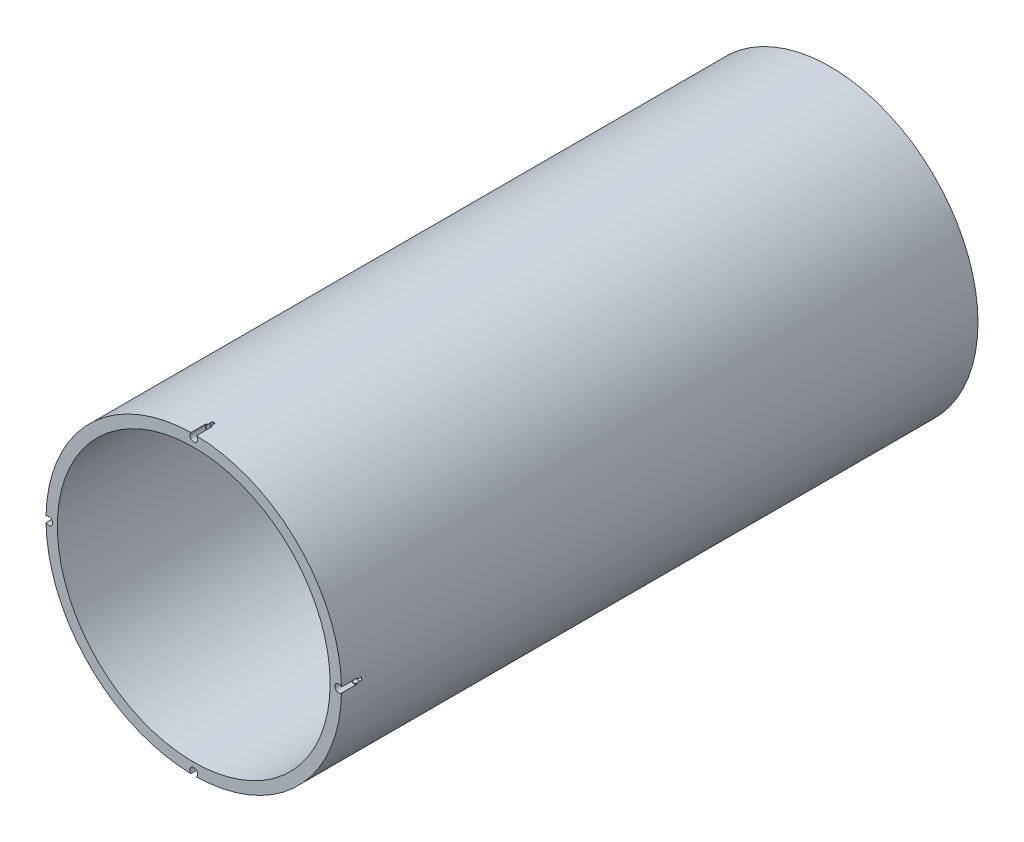
ISO-10303-21;
HEADER;
FILE_DESCRIPTION(('STEP AP214'),'2;1');
FILE_NAME('part.step','',(''),(''),'','','');
FILE_SCHEMA(('AUTOMOTIVE_DESIGN { 1 0 10303 214 1 1 1 1 }'));
ENDSEC;
DATA;
#1=APPLICATION_CONTEXT('core data for automotive mechanical design processes');
#2=APPLICATION_PROTOCOL_DEFINITION('international standard','automotive_design',2000,#1);
#3=PRODUCT_CONTEXT('',#1,'mechanical');
#4=PRODUCT('Part','Part','',(#3));
#5=PRODUCT_RELATED_PRODUCT_CATEGORY('part','',(#4));
#6=PRODUCT_DEFINITION_FORMATION('','',#4);
#7=PRODUCT_DEFINITION_CONTEXT('part definition',#1,'design');
#8=PRODUCT_DEFINITION('design','',#6,#7);
#9=PRODUCT_DEFINITION_SHAPE('','',#8);
#10=(LENGTH_UNIT() NAMED_UNIT(*) SI_UNIT(.MILLI.,.METRE.));
#11=(NAMED_UNIT(*) PLANE_ANGLE_UNIT() SI_UNIT($,.RADIAN.));
#12=(NAMED_UNIT(*) SI_UNIT($,.STERADIAN.) SOLID_ANGLE_UNIT());
#13=UNCERTAINTY_MEASURE_WITH_UNIT(LENGTH_MEASURE(1.E-05),#10,'distance_accuracy_value','');
#14=(GEOMETRIC_REPRESENTATION_CONTEXT(3) GLOBAL_UNCERTAINTY_ASSIGNED_CONTEXT((#13)) GLOBAL_UNIT_ASSIGNED_CONTEXT((#10,
#11,#12)) REPRESENTATION_CONTEXT('',''));
#15=CARTESIAN_POINT('',(0.,0.,0.));
#16=DIRECTION('',(0.,0.,1.));
#17=DIRECTION('',(1.,0.,0.));
#18=AXIS2_PLACEMENT_3D('',#15,#16,#17);
#19=CARTESIAN_POINT('',(0.,0.,177.8));
#20=DIRECTION('',(0.,0.,1.));
#21=DIRECTION('',(1.,0.,0.));
#22=AXIS2_PLACEMENT_3D('',#19,#20,#21);
#23=PLANE('',#22);
#24=CARTESIAN_POINT('',(0.,40.48125,177.8));
#25=DIRECTION('',(0.,0.,1.));
#26=DIRECTION('',(1.,0.,0.));
#27=AXIS2_PLACEMENT_3D('',#24,#25,#26);
#28=CIRCLE('',#27,1.0922);
#29=CARTESIAN_POINT('',(-0.757528844888312,41.2680478705882,177.8));
#30=VERTEX_POINT('',#29);
#31=CARTESIAN_POINT('',(0.757528844888305,41.2680478705882,177.8));
#32=VERTEX_POINT('',#31);
#33=EDGE_CURVE('E444',#30,#32,#28,.T.);
#34=ORIENTED_EDGE('',*,*,#33,.F.);
#35=CARTESIAN_POINT('',(0.,0.,177.8));
#36=DIRECTION('',(0.,0.,1.));
#37=DIRECTION('',(1.,0.,0.));
#38=AXIS2_PLACEMENT_3D('',#35,#36,#37);
#39=CIRCLE('',#38,41.275);
#40=CARTESIAN_POINT('',(-41.2680478705882,0.757528844888309,177.8));
#41=VERTEX_POINT('',#40);
#42=EDGE_CURVE('E270',#30,#41,#39,.T.);
#43=ORIENTED_EDGE('',*,*,#42,.T.);
#44=CARTESIAN_POINT('',(-40.48125,0.,177.8));
#45=DIRECTION('',(0.,0.,1.));
#46=DIRECTION('',(1.,0.,0.));
#47=AXIS2_PLACEMENT_3D('',#44,#45,#46);
#48=CIRCLE('',#47,1.0922);
#49=CARTESIAN_POINT('',(-41.2680478705882,-0.757528844888309,177.8));
#50=VERTEX_POINT('',#49);
#51=EDGE_CURVE('E222',#50,#41,#48,.T.);
#52=ORIENTED_EDGE('',*,*,#51,.F.);
#53=CARTESIAN_POINT('',(-0.757528844888286,-41.2680478705882,177.8));
#54=VERTEX_POINT('',#53);
#55=EDGE_CURVE('E204',#50,#54,#39,.T.);
#56=ORIENTED_EDGE('',*,*,#55,.T.);
#57=CARTESIAN_POINT('',(0.,-40.48125,177.8));
#58=DIRECTION('',(0.,0.,1.));
#59=DIRECTION('',(1.,0.,0.));
#60=AXIS2_PLACEMENT_3D('',#57,#58,#59);
#61=CIRCLE('',#60,1.0922);
#62=CARTESIAN_POINT('',(0.757528844888314,-41.2680478705882,177.8));
#63=VERTEX_POINT('',#62);
#64=EDGE_CURVE('E469',#63,#54,#61,.T.);
#65=ORIENTED_EDGE('',*,*,#64,.F.);
#66=CARTESIAN_POINT('',(41.2680478705882,-0.757528844888306,177.8));
#67=VERTEX_POINT('',#66);
#68=EDGE_CURVE('E283',#63,#67,#39,.T.);
#69=ORIENTED_EDGE('',*,*,#68,.T.);
#70=CARTESIAN_POINT('',(40.48125,0.,177.8));
#71=DIRECTION('',(0.,0.,1.));
#72=DIRECTION('',(1.,0.,0.));
#73=AXIS2_PLACEMENT_3D('',#70,#71,#72);
#74=CIRCLE('',#73,1.0922);
#75=CARTESIAN_POINT('',(41.2680478705882,0.757528844888307,177.8));
#76=VERTEX_POINT('',#75);
#77=EDGE_CURVE('E460',#76,#67,#74,.T.);
#78=ORIENTED_EDGE('',*,*,#77,.F.);
#79=EDGE_CURVE('E285',#76,#32,#39,.T.);
#80=ORIENTED_EDGE('',*,*,#79,.T.);
#81=EDGE_LOOP('',(#34,#43,#52,#56,#65,#69,#78,#80));
#82=FACE_BOUND('',#81,.T.);
#83=CARTESIAN_POINT('',(0.,0.,177.8));
#84=DIRECTION('',(0.,0.,1.));
#85=DIRECTION('',(1.,0.,0.));
#86=AXIS2_PLACEMENT_3D('',#83,#84,#85);
#87=CIRCLE('',#86,38.1);
#88=CARTESIAN_POINT('',(38.1,0.,177.8));
#89=VERTEX_POINT('',#88);
#90=EDGE_CURVE('E279',#89,#89,#87,.T.);
#91=ORIENTED_EDGE('',*,*,#90,.F.);
#92=EDGE_LOOP('',(#91));
#93=FACE_BOUND('',#92,.T.);
#94=ADVANCED_FACE('F33',(#82,#93),#23,.T.);
#95=CARTESIAN_POINT('',(0.,0.,0.));
#96=DIRECTION('',(0.,0.,1.));
#97=DIRECTION('',(1.,0.,0.));
#98=AXIS2_PLACEMENT_3D('',#95,#96,#97);
#99=PLANE('',#98);
#100=CARTESIAN_POINT('',(0.,0.,0.));
#101=DIRECTION('',(0.,0.,1.));
#102=DIRECTION('',(1.,0.,0.));
#103=AXIS2_PLACEMENT_3D('',#100,#101,#102);
#104=CIRCLE('',#103,41.275);
#105=CARTESIAN_POINT('',(41.275,0.,0.));
#106=VERTEX_POINT('',#105);
#107=EDGE_CURVE('E205',#106,#106,#104,.T.);
#108=ORIENTED_EDGE('',*,*,#107,.F.);
#109=EDGE_LOOP('',(#108));
#110=FACE_BOUND('',#109,.T.);
#111=CARTESIAN_POINT('',(0.,0.,0.));
#112=DIRECTION('',(0.,0.,1.));
#113=DIRECTION('',(1.,0.,0.));
#114=AXIS2_PLACEMENT_3D('',#111,#112,#113);
#115=CIRCLE('',#114,38.1);
#116=CARTESIAN_POINT('',(38.1,0.,0.));
#117=VERTEX_POINT('',#116);
#118=EDGE_CURVE('E278',#117,#117,#115,.T.);
#119=ORIENTED_EDGE('',*,*,#118,.T.);
#120=EDGE_LOOP('',(#119));
#121=FACE_BOUND('',#120,.T.);
#122=ADVANCED_FACE('F171',(#110,#121),#99,.F.);
#123=CARTESIAN_POINT('',(0.,0.,177.8));
#124=DIRECTION('',(0.,0.,-1.));
#125=DIRECTION('',(-1.,0.,0.));
#126=AXIS2_PLACEMENT_3D('',#123,#124,#125);
#127=CYLINDRICAL_SURFACE('',#126,41.275);
#128=CARTESIAN_POINT('',(0.,0.,173.482));
#129=DIRECTION('',(0.,0.,-1.));
#130=DIRECTION('',(-1.,0.,0.));
#131=AXIS2_PLACEMENT_3D('',#128,#129,#130);
#132=CIRCLE('',#131,41.275);
#133=CARTESIAN_POINT('',(0.404253387558908,41.2730202941176,173.482));
#134=VERTEX_POINT('',#133);
#135=CARTESIAN_POINT('',(0.757528844888313,41.2680478705882,173.482));
#136=VERTEX_POINT('',#135);
#137=EDGE_CURVE('E438',#134,#136,#132,.T.);
#138=ORIENTED_EDGE('',*,*,#137,.T.);
#139=DIRECTION('',(0.,0.,1.));
#140=VECTOR('',#139,1.);
#141=CARTESIAN_POINT('',(0.757528844888311,41.2680478705882,175.641));
#142=LINE('',#141,#140);
#143=EDGE_CURVE('E11',#136,#32,#142,.T.);
#144=ORIENTED_EDGE('',*,*,#143,.T.);
#145=ORIENTED_EDGE('',*,*,#79,.F.);
#146=DIRECTION('',(0.,0.,1.));
#147=VECTOR('',#146,1.);
#148=CARTESIAN_POINT('',(41.2680478705882,0.757528844888309,175.641));
#149=LINE('',#148,#147);
#150=CARTESIAN_POINT('',(41.2680478705882,0.757528844888307,173.482));
#151=VERTEX_POINT('',#150);
#152=EDGE_CURVE('E511',#76,#151,#149,.F.);
#153=ORIENTED_EDGE('',*,*,#152,.T.);
#154=CARTESIAN_POINT('',(0.,0.,173.482));
#155=DIRECTION('',(0.,0.,-1.));
#156=DIRECTION('',(-1.,0.,0.));
#157=AXIS2_PLACEMENT_3D('',#154,#155,#156);
#158=CIRCLE('',#157,41.275);
#159=CARTESIAN_POINT('',(41.2730202941176,0.404253387558913,173.482));
#160=VERTEX_POINT('',#159);
#161=EDGE_CURVE('E510',#151,#160,#158,.T.);
#162=ORIENTED_EDGE('',*,*,#161,.T.);
#163=DIRECTION('',(0.,0.,1.));
#164=VECTOR('',#163,1.);
#165=CARTESIAN_POINT('',(41.2730202941174,0.404253387559304,172.847));
#166=LINE('',#165,#164);
#167=CARTESIAN_POINT('',(41.2730202941174,0.404253387559304,172.212));
#168=VERTEX_POINT('',#167);
#169=EDGE_CURVE('E500',#160,#168,#166,.F.);
#170=ORIENTED_EDGE('',*,*,#169,.T.);
#171=CARTESIAN_POINT('',(41.2712754371427,0.554480650249963,172.257778713566));
#172=CARTESIAN_POINT('',(41.2716061109777,0.529858692359633,172.249448218284));
#173=CARTESIAN_POINT('',(41.2719163112154,0.505135934693026,172.241448933723));
#174=CARTESIAN_POINT('',(41.2724960802549,0.455323857671428,172.226207537935));
#175=CARTESIAN_POINT('',(41.2727654391787,0.430233326412741,172.218969392764));
#176=CARTESIAN_POINT('',(41.2737818802846,0.32661909738651,172.1911735472));
#177=CARTESIAN_POINT('',(41.2743403074999,0.246853127221572,172.174669568734));
#178=CARTESIAN_POINT('',(41.2748269352377,0.126118405252516,172.160065896399));
#179=CARTESIAN_POINT('',(41.2749307424957,0.0857504999576255,172.15688740649));
#180=CARTESIAN_POINT('',(41.2750194873657,0.00489743534617373,172.154172578929));
#181=CARTESIAN_POINT('',(41.2750044553574,-0.0355876913589537,172.154635310445));
#182=CARTESIAN_POINT('',(41.2748277468338,-0.13153912255078,172.160029901786));
#183=CARTESIAN_POINT('',(41.2746130927497,-0.186918789335815,172.166575650672));
#184=CARTESIAN_POINT('',(41.2741310395732,-0.269242013656875,172.18071182608));
#185=CARTESIAN_POINT('',(41.2739433744354,-0.296589103074054,172.186152050597));
#186=CARTESIAN_POINT('',(41.2735164402987,-0.351005009796493,172.198284458301));
#187=CARTESIAN_POINT('',(41.2732771722207,-0.37807383205891,172.204976619145));
#188=CARTESIAN_POINT('',(41.2722501796655,-0.482741588373484,172.233056332517));
#189=CARTESIAN_POINT('',(41.2712796157132,-0.559287634984945,172.258341293869));
#190=CARTESIAN_POINT('',(41.2689548077908,-0.71043727308001,172.314193263803));
#191=CARTESIAN_POINT('',(41.2676000029626,-0.785037849745805,172.344767967939));
#192=CARTESIAN_POINT('',(41.2645198702088,-0.933010241206817,172.409164782756));
#193=CARTESIAN_POINT('',(41.2627936833271,-1.00637877503008,172.442994319416));
#194=CARTESIAN_POINT('',(41.2589820909338,-1.15209824952124,172.512631378532));
#195=CARTESIAN_POINT('',(41.2568968902218,-1.22444974504585,172.548437765424));
#196=CARTESIAN_POINT('',(41.2539701333518,-1.3175807386543,172.595596846185));
#197=CARTESIAN_POINT('',(41.2532910897392,-1.33867217795007,172.606348440606));
#198=CARTESIAN_POINT('',(41.2519037047109,-1.38076378421237,172.62793487089));
#199=CARTESIAN_POINT('',(41.2511954178712,-1.40176404695596,172.638769523466));
#200=CARTESIAN_POINT('',(41.2504719420703,-1.42274015774925,172.649650007383));
#201=B_SPLINE_CURVE_WITH_KNOTS('',3,(#171,#172,#173,#174,#175,#176,#177,#178,#179,#180,#181,
#182,#183,#184,#185,#186,#187,#188,#189,#190,#191,#192,#193,#194,#195,#196,#197,#198,#199,#200),
.UNSPECIFIED.,.F.,.F.,(4,2,2,2,2,2,2,2,2,2,2,2,2,2,4),(0.,0.0779588551804147,0.156305661087652,
0.399659160270447,0.520992553245829,0.642294929872764,0.809175092958246,0.892803863874903,
0.976431142406077,1.21789125140515,1.45970563834414,1.70208543970131,1.94432743071921,
2.01537771547088,2.08630091618501),.UNSPECIFIED.);
#202=CARTESIAN_POINT('',(41.2730202941176,-0.404253387559277,172.212));
#203=VERTEX_POINT('',#202);
#204=EDGE_CURVE('E490',#168,#203,#201,.T.);
#205=ORIENTED_EDGE('',*,*,#204,.T.);
#206=DIRECTION('',(0.,0.,1.));
#207=VECTOR('',#206,1.);
#208=CARTESIAN_POINT('',(41.2730202941174,-0.404253387559304,172.847));
#209=LINE('',#208,#207);
#210=CARTESIAN_POINT('',(41.2730202941176,-0.404253387558913,173.482));
#211=VERTEX_POINT('',#210);
#212=EDGE_CURVE('E504',#203,#211,#209,.T.);
#213=ORIENTED_EDGE('',*,*,#212,.T.);
#214=CARTESIAN_POINT('',(41.2680478705882,-0.757528844888306,173.482));
#215=VERTEX_POINT('',#214);
#216=EDGE_CURVE('E507',#211,#215,#158,.T.);
#217=ORIENTED_EDGE('',*,*,#216,.T.);
#218=DIRECTION('',(0.,0.,1.));
#219=VECTOR('',#218,1.);
#220=CARTESIAN_POINT('',(41.2680478705882,-0.757528844888309,175.641));
#221=LINE('',#220,#219);
#222=EDGE_CURVE('E514',#215,#67,#221,.T.);
#223=ORIENTED_EDGE('',*,*,#222,.T.);
#224=ORIENTED_EDGE('',*,*,#68,.F.);
#225=DIRECTION('',(0.,0.,1.));
#226=VECTOR('',#225,1.);
#227=CARTESIAN_POINT('',(0.757528844888314,-41.2680478705882,175.641));
#228=LINE('',#227,#226);
#229=CARTESIAN_POINT('',(0.757528844888314,-41.2680478705882,173.482));
#230=VERTEX_POINT('',#229);
#231=EDGE_CURVE('E483',#63,#230,#228,.F.);
#232=ORIENTED_EDGE('',*,*,#231,.T.);
#233=CARTESIAN_POINT('',(0.,0.,173.482));
#234=DIRECTION('',(0.,0.,-1.));
#235=DIRECTION('',(-1.,0.,0.));
#236=AXIS2_PLACEMENT_3D('',#233,#234,#235);
#237=CIRCLE('',#236,41.275);
#238=CARTESIAN_POINT('',(0.404253387559315,-41.2730202941174,173.482));
#239=VERTEX_POINT('',#238);
#240=EDGE_CURVE('E484',#230,#239,#237,.T.);
#241=ORIENTED_EDGE('',*,*,#240,.T.);
#242=DIRECTION('',(0.,0.,1.));
#243=VECTOR('',#242,1.);
#244=CARTESIAN_POINT('',(0.404253387559313,-41.2730202941174,172.847));
#245=LINE('',#244,#243);
#246=CARTESIAN_POINT('',(0.404253387559313,-41.2730202941174,172.212));
#247=VERTEX_POINT('',#246);
#248=EDGE_CURVE('E230',#239,#247,#245,.F.);
#249=ORIENTED_EDGE('',*,*,#248,.T.);
#250=CARTESIAN_POINT('',(0.55448065024997,-41.2712754371427,172.257778713566));
#251=CARTESIAN_POINT('',(0.529858692359637,-41.2716061109777,172.249448218284));
#252=CARTESIAN_POINT('',(0.505135934693028,-41.2719163112154,172.241448933723));
#253=CARTESIAN_POINT('',(0.455323857671424,-41.2724960802549,172.226207537935));
#254=CARTESIAN_POINT('',(0.430233326412735,-41.2727654391787,172.218969392764));
#255=CARTESIAN_POINT('',(0.326619097386501,-41.2737818802846,172.1911735472));
#256=CARTESIAN_POINT('',(0.246853127221559,-41.2743403074999,172.174669568734));
#257=CARTESIAN_POINT('',(0.126118405252504,-41.2748269352377,172.160065896399));
#258=CARTESIAN_POINT('',(0.0857504999576139,-41.2749307424957,172.15688740649));
#259=CARTESIAN_POINT('',(0.00489743534616249,-41.2750194873657,172.154172578929));
#260=CARTESIAN_POINT('',(-0.0355876913589652,-41.2750044553574,172.154635310445));
#261=CARTESIAN_POINT('',(-0.131539122550787,-41.2748277468338,172.160029901786));
#262=CARTESIAN_POINT('',(-0.186918789335817,-41.2746130927497,172.166575650672));
#263=CARTESIAN_POINT('',(-0.269242013656871,-41.2741310395732,172.18071182608));
#264=CARTESIAN_POINT('',(-0.296589103074048,-41.2739433744354,172.186152050597));
#265=CARTESIAN_POINT('',(-0.351005009796483,-41.2735164402987,172.198284458301));
#266=CARTESIAN_POINT('',(-0.378073832058898,-41.2732771722207,172.204976619145));
#267=CARTESIAN_POINT('',(-0.482741588373469,-41.2722501796655,172.233056332517));
#268=CARTESIAN_POINT('',(-0.55928763498493,-41.2712796157132,172.258341293869));
#269=CARTESIAN_POINT('',(-0.710437273079994,-41.2689548077908,172.314193263803));
#270=CARTESIAN_POINT('',(-0.785037849745788,-41.2676000029626,172.344767967939));
#271=CARTESIAN_POINT('',(-0.933010241206799,-41.2645198702088,172.409164782756));
#272=CARTESIAN_POINT('',(-1.00637877503007,-41.2627936833271,172.442994319416));
#273=CARTESIAN_POINT('',(-1.15209824952123,-41.2589820909338,172.512631378532));
#274=CARTESIAN_POINT('',(-1.22444974504583,-41.2568968902218,172.548437765424));
#275=CARTESIAN_POINT('',(-1.31758073865428,-41.2539701333518,172.595596846185));
#276=CARTESIAN_POINT('',(-1.33867217795005,-41.2532910897392,172.606348440606));
#277=CARTESIAN_POINT('',(-1.38076378421235,-41.2519037047109,172.62793487089));
#278=CARTESIAN_POINT('',(-1.40176404695595,-41.2511954178712,172.638769523466));
#279=CARTESIAN_POINT('',(-1.42274015774924,-41.2504719420703,172.649650007383));
#280=B_SPLINE_CURVE_WITH_KNOTS('',3,(#250,#251,#252,#253,#254,#255,#256,#257,#258,#259,#260,
#261,#262,#263,#264,#265,#266,#267,#268,#269,#270,#271,#272,#273,#274,#275,#276,#277,#278,#279),
.UNSPECIFIED.,.F.,.F.,(4,2,2,2,2,2,2,2,2,2,2,2,2,2,4),(0.,0.0779588551804216,0.156305661087667,
0.39965916027046,0.520992553245843,0.642294929872778,0.809175092958247,0.892803863874897,
0.976431142406066,1.21789125140514,1.45970563834413,1.7020854397013,1.9443274307192,
2.01537771547087,2.08630091618499),.UNSPECIFIED.);
#281=CARTESIAN_POINT('',(-0.404253387559264,-41.2730202941177,172.212));
#282=VERTEX_POINT('',#281);
#283=EDGE_CURVE('E223',#247,#282,#280,.T.);
#284=ORIENTED_EDGE('',*,*,#283,.T.);
#285=DIRECTION('',(0.,0.,1.));
#286=VECTOR('',#285,1.);
#287=CARTESIAN_POINT('',(-0.404253387559292,-41.2730202941174,172.847));
#288=LINE('',#287,#286);
#289=CARTESIAN_POINT('',(-0.404253387558898,-41.2730202941176,173.482));
#290=VERTEX_POINT('',#289);
#291=EDGE_CURVE('E481',#282,#290,#288,.T.);
#292=ORIENTED_EDGE('',*,*,#291,.T.);
#293=CARTESIAN_POINT('',(-0.757528844888286,-41.2680478705882,173.482));
#294=VERTEX_POINT('',#293);
#295=EDGE_CURVE('E488',#290,#294,#237,.T.);
#296=ORIENTED_EDGE('',*,*,#295,.T.);
#297=DIRECTION('',(0.,0.,1.));
#298=VECTOR('',#297,1.);
#299=CARTESIAN_POINT('',(-0.757528844888293,-41.2680478705882,175.641));
#300=LINE('',#299,#298);
#301=EDGE_CURVE('E489',#294,#54,#300,.T.);
#302=ORIENTED_EDGE('',*,*,#301,.T.);
#303=ORIENTED_EDGE('',*,*,#55,.F.);
#304=DIRECTION('',(0.,0.,1.));
#305=VECTOR('',#304,1.);
#306=CARTESIAN_POINT('',(-41.2680478705882,-0.757528844888309,175.641));
#307=LINE('',#306,#305);
#308=CARTESIAN_POINT('',(-41.2680478705882,-0.757528844888315,173.482));
#309=VERTEX_POINT('',#308);
#310=EDGE_CURVE('E216',#50,#309,#307,.F.);
#311=ORIENTED_EDGE('',*,*,#310,.T.);
#312=CARTESIAN_POINT('',(0.,0.,173.482));
#313=DIRECTION('',(0.,0.,-1.));
#314=DIRECTION('',(-1.,0.,0.));
#315=AXIS2_PLACEMENT_3D('',#312,#313,#314);
#316=CIRCLE('',#315,41.275);
#317=CARTESIAN_POINT('',(-41.2730202941174,-0.404253387559302,173.482));
#318=VERTEX_POINT('',#317);
#319=EDGE_CURVE('E212',#309,#318,#316,.T.);
#320=ORIENTED_EDGE('',*,*,#319,.T.);
#321=DIRECTION('',(0.,0.,1.));
#322=VECTOR('',#321,1.);
#323=CARTESIAN_POINT('',(-41.2730202941174,-0.404253387559304,172.847));
#324=LINE('',#323,#322);
#325=CARTESIAN_POINT('',(-41.2730202941174,-0.404253387559304,172.212));
#326=VERTEX_POINT('',#325);
#327=EDGE_CURVE('E203',#318,#326,#324,.F.);
#328=ORIENTED_EDGE('',*,*,#327,.T.);
#329=CARTESIAN_POINT('',(-41.2712754371427,-0.554480650249963,172.257778713566));
#330=CARTESIAN_POINT('',(-41.2716061109777,-0.529858692359633,172.249448218284));
#331=CARTESIAN_POINT('',(-41.2719163112154,-0.505135934693027,172.241448933723));
#332=CARTESIAN_POINT('',(-41.2724960802549,-0.455323857671431,172.226207537935));
#333=CARTESIAN_POINT('',(-41.2727654391787,-0.430233326412745,172.218969392764));
#334=CARTESIAN_POINT('',(-41.2737818802846,-0.326619097386516,172.1911735472));
#335=CARTESIAN_POINT('',(-41.2743403074999,-0.246853127221574,172.174669568734));
#336=CARTESIAN_POINT('',(-41.2748269352377,-0.12611840525252,172.160065896399));
#337=CARTESIAN_POINT('',(-41.2749307424957,-0.0857504999576297,172.15688740649));
#338=CARTESIAN_POINT('',(-41.2750194873657,-0.00489743534617841,172.154172578929));
#339=CARTESIAN_POINT('',(-41.2750044553574,0.0355876913589492,172.154635310445));
#340=CARTESIAN_POINT('',(-41.2748277468338,0.131539122550776,172.160029901786));
#341=CARTESIAN_POINT('',(-41.2746130927497,0.18691878933581,172.166575650672));
#342=CARTESIAN_POINT('',(-41.2741310395732,0.26924201365687,172.18071182608));
#343=CARTESIAN_POINT('',(-41.2739433744354,0.29658910307405,172.186152050597));
#344=CARTESIAN_POINT('',(-41.2735164402987,0.351005009796489,172.198284458301));
#345=CARTESIAN_POINT('',(-41.2732771722207,0.378073832058906,172.204976619145));
#346=CARTESIAN_POINT('',(-41.2722501796655,0.482741588373479,172.233056332517));
#347=CARTESIAN_POINT('',(-41.2712796157132,0.559287634984941,172.258341293869));
#348=CARTESIAN_POINT('',(-41.2689548077908,0.710437273080007,172.314193263803));
#349=CARTESIAN_POINT('',(-41.2676000029626,0.785037849745804,172.344767967939));
#350=CARTESIAN_POINT('',(-41.2645198702088,0.93301024120681,172.409164782756));
#351=CARTESIAN_POINT('',(-41.2627936833271,1.00637877503007,172.442994319416));
#352=CARTESIAN_POINT('',(-41.2589820909338,1.15209824952124,172.512631378532));
#353=CARTESIAN_POINT('',(-41.2568968902218,1.22444974504585,172.548437765424));
#354=CARTESIAN_POINT('',(-41.2539701333518,1.31758073865429,172.595596846185));
#355=CARTESIAN_POINT('',(-41.2532910897392,1.33867217795006,172.606348440606));
#356=CARTESIAN_POINT('',(-41.2519037047109,1.38076378421236,172.62793487089));
#357=CARTESIAN_POINT('',(-41.2511954178712,1.40176404695596,172.638769523466));
#358=CARTESIAN_POINT('',(-41.2504719420703,1.42274015774925,172.649650007383));
#359=B_SPLINE_CURVE_WITH_KNOTS('',3,(#329,#330,#331,#332,#333,#334,#335,#336,#337,#338,#339,
#340,#341,#342,#343,#344,#345,#346,#347,#348,#349,#350,#351,#352,#353,#354,#355,#356,#357,#358),
.UNSPECIFIED.,.F.,.F.,(4,2,2,2,2,2,2,2,2,2,2,2,2,2,4),(0.,0.0779588551804126,0.156305661087648,
0.399659160270438,0.520992553245822,0.642294929872756,0.809175092958237,0.892803863874895,
0.976431142406069,1.21789125140514,1.45970563834414,1.70208543970129,1.94432743071919,
2.01537771547087,2.086300916185),.UNSPECIFIED.);
#360=CARTESIAN_POINT('',(-41.2730202941176,0.404253387559277,172.212));
#361=VERTEX_POINT('',#360);
#362=EDGE_CURVE('E196',#326,#361,#359,.T.);
#363=ORIENTED_EDGE('',*,*,#362,.T.);
#364=DIRECTION('',(0.,0.,1.));
#365=VECTOR('',#364,1.);
#366=CARTESIAN_POINT('',(-41.2730202941174,0.404253387559304,172.847));
#367=LINE('',#366,#365);
#368=CARTESIAN_POINT('',(-41.2730202941174,0.404253387559302,173.482));
#369=VERTEX_POINT('',#368);
#370=EDGE_CURVE('E209',#361,#369,#367,.T.);
#371=ORIENTED_EDGE('',*,*,#370,.T.);
#372=CARTESIAN_POINT('',(-41.2680478705882,0.757528844888309,173.482));
#373=VERTEX_POINT('',#372);
#374=EDGE_CURVE('E215',#369,#373,#316,.T.);
#375=ORIENTED_EDGE('',*,*,#374,.T.);
#376=DIRECTION('',(0.,0.,1.));
#377=VECTOR('',#376,1.);
#378=CARTESIAN_POINT('',(-41.2680478705882,0.757528844888309,175.641));
#379=LINE('',#378,#377);
#380=EDGE_CURVE('E219',#373,#41,#379,.T.);
#381=ORIENTED_EDGE('',*,*,#380,.T.);
#382=ORIENTED_EDGE('',*,*,#42,.F.);
#383=DIRECTION('',(0.,0.,1.));
#384=VECTOR('',#383,1.);
#385=CARTESIAN_POINT('',(-0.75752884488831,41.2680478705882,175.641));
#386=LINE('',#385,#384);
#387=CARTESIAN_POINT('',(-0.757528844888311,41.2680478705882,173.482));
#388=VERTEX_POINT('',#387);
#389=EDGE_CURVE('E42',#30,#388,#386,.F.);
#390=ORIENTED_EDGE('',*,*,#389,.T.);
#391=CARTESIAN_POINT('',(-0.404253387558908,41.2730202941176,173.482));
#392=VERTEX_POINT('',#391);
#393=EDGE_CURVE('E441',#388,#392,#132,.T.);
#394=ORIENTED_EDGE('',*,*,#393,.T.);
#395=DIRECTION('',(0.,0.,1.));
#396=VECTOR('',#395,1.);
#397=CARTESIAN_POINT('',(-0.404253387559302,41.2730202941174,172.847));
#398=LINE('',#397,#396);
#399=CARTESIAN_POINT('',(-0.404253387559302,41.2730202941174,172.212));
#400=VERTEX_POINT('',#399);
#401=EDGE_CURVE('E451',#392,#400,#398,.F.);
#402=ORIENTED_EDGE('',*,*,#401,.T.);
#403=CARTESIAN_POINT('',(-0.554480650249961,41.2712754371427,172.257778713566));
#404=CARTESIAN_POINT('',(-0.529858692359633,41.2716061109777,172.249448218284));
#405=CARTESIAN_POINT('',(-0.505135934693028,41.2719163112154,172.241448933723));
#406=CARTESIAN_POINT('',(-0.455323857671435,41.2724960802549,172.226207537935));
#407=CARTESIAN_POINT('',(-0.430233326412751,41.2727654391787,172.218969392764));
#408=CARTESIAN_POINT('',(-0.326619097386523,41.2737818802846,172.1911735472));
#409=CARTESIAN_POINT('',(-0.246853127221579,41.2743403074998,172.174669568734));
#410=CARTESIAN_POINT('',(-0.126118405252524,41.2748269352377,172.160065896399));
#411=CARTESIAN_POINT('',(-0.0857504999576356,41.2749307424957,172.15688740649));
#412=CARTESIAN_POINT('',(-0.00489743534618704,41.2750194873657,172.154172578929));
#413=CARTESIAN_POINT('',(0.0355876913589392,41.2750044553574,172.154635310445));
#414=CARTESIAN_POINT('',(0.131539122550771,41.2748277468338,172.160029901786));
#415=CARTESIAN_POINT('',(0.186918789335812,41.2746130927497,172.166575650672));
#416=CARTESIAN_POINT('',(0.269242013656879,41.2741310395731,172.18071182608));
#417=CARTESIAN_POINT('',(0.296589103074058,41.2739433744354,172.186152050597));
#418=CARTESIAN_POINT('',(0.351005009796498,41.2735164402987,172.198284458301));
#419=CARTESIAN_POINT('',(0.378073832058915,41.2732771722207,172.204976619145));
#420=CARTESIAN_POINT('',(0.482741588373488,41.2722501796655,172.233056332517));
#421=CARTESIAN_POINT('',(0.559287634984949,41.2712796157132,172.258341293869));
#422=CARTESIAN_POINT('',(0.710437273080012,41.2689548077908,172.314193263803));
#423=CARTESIAN_POINT('',(0.785037849745806,41.2676000029626,172.344767967939));
#424=CARTESIAN_POINT('',(0.933010241206817,41.2645198702088,172.409164782756));
#425=CARTESIAN_POINT('',(1.00637877503008,41.2627936833271,172.442994319416));
#426=CARTESIAN_POINT('',(1.15209824952124,41.2589820909338,172.512631378532));
#427=CARTESIAN_POINT('',(1.22444974504585,41.2568968902218,172.548437765424));
#428=CARTESIAN_POINT('',(1.3175807386543,41.2539701333518,172.595596846185));
#429=CARTESIAN_POINT('',(1.33867217795007,41.2532910897392,172.606348440606));
#430=CARTESIAN_POINT('',(1.38076378421237,41.2519037047109,172.62793487089));
#431=CARTESIAN_POINT('',(1.40176404695596,41.2511954178712,172.638769523466));
#432=CARTESIAN_POINT('',(1.42274015774925,41.2504719420703,172.649650007383));
#433=B_SPLINE_CURVE_WITH_KNOTS('',3,(#403,#404,#405,#406,#407,#408,#409,#410,#411,#412,#413,
#414,#415,#416,#417,#418,#419,#420,#421,#422,#423,#424,#425,#426,#427,#428,#429,#430,#431,#432),
.UNSPECIFIED.,.F.,.F.,(4,2,2,2,2,2,2,2,2,2,2,2,2,2,4),(0.,0.0779588551804085,0.156305661087638,
0.399659160270433,0.520992553245813,0.642294929872743,0.809175092958245,0.892803863874903,
0.976431142406077,1.21789125140515,1.45970563834414,1.70208543970131,1.94432743071921,
2.01537771547087,2.086300916185),.UNSPECIFIED.);
#434=CARTESIAN_POINT('',(0.404253387559276,41.2730202941176,172.212));
#435=VERTEX_POINT('',#434);
#436=EDGE_CURVE('E517',#400,#435,#433,.T.);
#437=ORIENTED_EDGE('',*,*,#436,.T.);
#438=DIRECTION('',(0.,0.,1.));
#439=VECTOR('',#438,1.);
#440=CARTESIAN_POINT('',(0.404253387559303,41.2730202941174,172.847));
#441=LINE('',#440,#439);
#442=EDGE_CURVE('E449',#435,#134,#441,.T.);
#443=ORIENTED_EDGE('',*,*,#442,.T.);
#444=EDGE_LOOP('',(#138,#144,#145,#153,#162,#170,#205,#213,#217,#223,#224,#232,#241,#249,#284,
#292,#296,#302,#303,#311,#320,#328,#363,#371,#375,#381,#382,#390,#394,#402,#437,#443));
#445=FACE_BOUND('',#444,.T.);
#446=ORIENTED_EDGE('',*,*,#107,.T.);
#447=EDGE_LOOP('',(#446));
#448=FACE_BOUND('',#447,.T.);
#449=ADVANCED_FACE('F35',(#445,#448),#127,.T.);
#450=CARTESIAN_POINT('',(0.,0.,177.8));
#451=DIRECTION('',(0.,0.,-1.));
#452=DIRECTION('',(-1.,0.,0.));
#453=AXIS2_PLACEMENT_3D('',#450,#451,#452);
#454=CYLINDRICAL_SURFACE('',#453,38.1);
#455=ORIENTED_EDGE('',*,*,#90,.T.);
#456=EDGE_LOOP('',(#455));
#457=FACE_BOUND('',#456,.T.);
#458=ORIENTED_EDGE('',*,*,#118,.F.);
#459=EDGE_LOOP('',(#458));
#460=FACE_BOUND('',#459,.T.);
#461=ADVANCED_FACE('F181',(#457,#460),#454,.F.);
#462=CARTESIAN_POINT('',(-39.59225,0.,173.482));
#463=DIRECTION('',(0.,0.,-1.));
#464=DIRECTION('',(-1.,0.,0.));
#465=AXIS2_PLACEMENT_3D('',#462,#463,#464);
#466=PLANE('',#465);
#467=CARTESIAN_POINT('',(-40.48125,0.,173.482));
#468=DIRECTION('',(0.,0.,1.));
#469=DIRECTION('',(1.,0.,0.));
#470=AXIS2_PLACEMENT_3D('',#467,#468,#469);
#471=CIRCLE('',#470,0.889000000000001);
#472=EDGE_CURVE('E252',#318,#369,#471,.T.);
#473=ORIENTED_EDGE('',*,*,#472,.F.);
#474=ORIENTED_EDGE('',*,*,#319,.F.);
#475=CARTESIAN_POINT('',(-40.48125,0.,173.482));
#476=DIRECTION('',(0.,0.,1.));
#477=DIRECTION('',(1.,0.,0.));
#478=AXIS2_PLACEMENT_3D('',#475,#476,#477);
#479=CIRCLE('',#478,1.0922);
#480=EDGE_CURVE('E258',#309,#373,#479,.T.);
#481=ORIENTED_EDGE('',*,*,#480,.T.);
#482=ORIENTED_EDGE('',*,*,#374,.F.);
#483=EDGE_LOOP('',(#473,#474,#481,#482));
#484=FACE_BOUND('',#483,.T.);
#485=ADVANCED_FACE('F184',(#484),#466,.F.);
#486=CARTESIAN_POINT('',(-40.48125,0.,177.8));
#487=DIRECTION('',(0.,0.,1.));
#488=DIRECTION('',(1.,0.,0.));
#489=AXIS2_PLACEMENT_3D('',#486,#487,#488);
#490=CYLINDRICAL_SURFACE('',#489,0.889000000000001);
#491=CARTESIAN_POINT('',(-40.48125,0.,172.212));
#492=DIRECTION('',(0.,0.,1.));
#493=DIRECTION('',(1.,0.,0.));
#494=AXIS2_PLACEMENT_3D('',#491,#492,#493);
#495=CIRCLE('',#494,0.889000000000001);
#496=EDGE_CURVE('E257',#326,#361,#495,.T.);
#497=ORIENTED_EDGE('',*,*,#496,.F.);
#498=ORIENTED_EDGE('',*,*,#327,.F.);
#499=ORIENTED_EDGE('',*,*,#472,.T.);
#500=ORIENTED_EDGE('',*,*,#370,.F.);
#501=EDGE_LOOP('',(#497,#498,#499,#500));
#502=FACE_BOUND('',#501,.T.);
#503=ADVANCED_FACE('F193',(#502),#490,.F.);
#504=CARTESIAN_POINT('',(-40.48125,0.,177.8));
#505=DIRECTION('',(0.,0.,1.));
#506=DIRECTION('',(1.,0.,0.));
#507=AXIS2_PLACEMENT_3D('',#504,#505,#506);
#508=CYLINDRICAL_SURFACE('',#507,1.0922);
#509=ORIENTED_EDGE('',*,*,#480,.F.);
#510=ORIENTED_EDGE('',*,*,#310,.F.);
#511=ORIENTED_EDGE('',*,*,#51,.T.);
#512=ORIENTED_EDGE('',*,*,#380,.F.);
#513=EDGE_LOOP('',(#509,#510,#511,#512));
#514=FACE_BOUND('',#513,.T.);
#515=ADVANCED_FACE('F191',(#514),#508,.F.);
#516=CARTESIAN_POINT('',(-40.48125,0.,172.212));
#517=DIRECTION('',(0.,0.,1.));
#518=DIRECTION('',(1.,0.,0.));
#519=AXIS2_PLACEMENT_3D('',#516,#517,#518);
#520=CONICAL_SURFACE('',#519,0.889000000000001,1.02974425867667);
#521=CARTESIAN_POINT('',(-40.48125,0.,171.677834909684));
#522=VERTEX_POINT('',#521);
#523=VERTEX_LOOP('',#522);
#524=FACE_BOUND('',#523,.T.);
#525=ORIENTED_EDGE('',*,*,#496,.T.);
#526=ORIENTED_EDGE('',*,*,#362,.F.);
#527=EDGE_LOOP('',(#525,#526));
#528=FACE_BOUND('',#527,.T.);
#529=ADVANCED_FACE('F186',(#524,#528),#520,.F.);
#530=CARTESIAN_POINT('',(0.889000000000009,-40.48125,173.482));
#531=DIRECTION('',(0.,0.,-1.));
#532=DIRECTION('',(-1.,0.,0.));
#533=AXIS2_PLACEMENT_3D('',#530,#531,#532);
#534=PLANE('',#533);
#535=CARTESIAN_POINT('',(0.,-40.48125,173.482));
#536=DIRECTION('',(0.,0.,1.));
#537=DIRECTION('',(1.,0.,0.));
#538=AXIS2_PLACEMENT_3D('',#535,#536,#537);
#539=CIRCLE('',#538,1.0922);
#540=EDGE_CURVE('E471',#230,#294,#539,.T.);
#541=ORIENTED_EDGE('',*,*,#540,.T.);
#542=ORIENTED_EDGE('',*,*,#295,.F.);
#543=CARTESIAN_POINT('',(0.,-40.48125,173.482));
#544=DIRECTION('',(0.,0.,1.));
#545=DIRECTION('',(1.,0.,0.));
#546=AXIS2_PLACEMENT_3D('',#543,#544,#545);
#547=CIRCLE('',#546,0.888999999999999);
#548=EDGE_CURVE('E473',#239,#290,#547,.T.);
#549=ORIENTED_EDGE('',*,*,#548,.F.);
#550=ORIENTED_EDGE('',*,*,#240,.F.);
#551=EDGE_LOOP('',(#541,#542,#549,#550));
#552=FACE_BOUND('',#551,.T.);
#553=ADVANCED_FACE('F190',(#552),#534,.F.);
#554=CARTESIAN_POINT('',(0.,-40.48125,177.8));
#555=DIRECTION('',(0.,0.,1.));
#556=DIRECTION('',(1.,0.,0.));
#557=AXIS2_PLACEMENT_3D('',#554,#555,#556);
#558=CYLINDRICAL_SURFACE('',#557,0.888999999999999);
#559=CARTESIAN_POINT('',(0.,-40.48125,172.212));
#560=DIRECTION('',(0.,0.,1.));
#561=DIRECTION('',(1.,0.,0.));
#562=AXIS2_PLACEMENT_3D('',#559,#560,#561);
#563=CIRCLE('',#562,0.888999999999999);
#564=EDGE_CURVE('E274',#247,#282,#563,.T.);
#565=ORIENTED_EDGE('',*,*,#564,.F.);
#566=ORIENTED_EDGE('',*,*,#248,.F.);
#567=ORIENTED_EDGE('',*,*,#548,.T.);
#568=ORIENTED_EDGE('',*,*,#291,.F.);
#569=EDGE_LOOP('',(#565,#566,#567,#568));
#570=FACE_BOUND('',#569,.T.);
#571=ADVANCED_FACE('F240',(#570),#558,.F.);
#572=CARTESIAN_POINT('',(0.,-40.48125,177.8));
#573=DIRECTION('',(0.,0.,1.));
#574=DIRECTION('',(1.,0.,0.));
#575=AXIS2_PLACEMENT_3D('',#572,#573,#574);
#576=CYLINDRICAL_SURFACE('',#575,1.0922);
#577=ORIENTED_EDGE('',*,*,#540,.F.);
#578=ORIENTED_EDGE('',*,*,#231,.F.);
#579=ORIENTED_EDGE('',*,*,#64,.T.);
#580=ORIENTED_EDGE('',*,*,#301,.F.);
#581=EDGE_LOOP('',(#577,#578,#579,#580));
#582=FACE_BOUND('',#581,.T.);
#583=ADVANCED_FACE('F238',(#582),#576,.F.);
#584=CARTESIAN_POINT('',(0.,-40.48125,172.212));
#585=DIRECTION('',(0.,0.,1.));
#586=DIRECTION('',(1.,0.,0.));
#587=AXIS2_PLACEMENT_3D('',#584,#585,#586);
#588=CONICAL_SURFACE('',#587,0.888999999999999,1.02974425867667);
#589=CARTESIAN_POINT('',(0.,-40.48125,171.677834909684));
#590=VERTEX_POINT('',#589);
#591=VERTEX_LOOP('',#590);
#592=FACE_BOUND('',#591,.T.);
#593=ORIENTED_EDGE('',*,*,#564,.T.);
#594=ORIENTED_EDGE('',*,*,#283,.F.);
#595=EDGE_LOOP('',(#593,#594));
#596=FACE_BOUND('',#595,.T.);
#597=ADVANCED_FACE('F232',(#592,#596),#588,.F.);
#598=CARTESIAN_POINT('',(40.48125,0.,177.8));
#599=DIRECTION('',(0.,0.,1.));
#600=DIRECTION('',(1.,0.,0.));
#601=AXIS2_PLACEMENT_3D('',#598,#599,#600);
#602=CYLINDRICAL_SURFACE('',#601,0.889000000000001);
#603=CARTESIAN_POINT('',(40.48125,0.,172.212));
#604=DIRECTION('',(0.,0.,1.));
#605=DIRECTION('',(1.,0.,0.));
#606=AXIS2_PLACEMENT_3D('',#603,#604,#605);
#607=CIRCLE('',#606,0.889000000000001);
#608=EDGE_CURVE('E55',#168,#203,#607,.T.);
#609=ORIENTED_EDGE('',*,*,#608,.F.);
#610=ORIENTED_EDGE('',*,*,#169,.F.);
#611=CARTESIAN_POINT('',(40.48125,0.,173.482));
#612=DIRECTION('',(0.,0.,1.));
#613=DIRECTION('',(1.,0.,0.));
#614=AXIS2_PLACEMENT_3D('',#611,#612,#613);
#615=CIRCLE('',#614,0.889000000000001);
#616=EDGE_CURVE('E465',#160,#211,#615,.T.);
#617=ORIENTED_EDGE('',*,*,#616,.T.);
#618=ORIENTED_EDGE('',*,*,#212,.F.);
#619=EDGE_LOOP('',(#609,#610,#617,#618));
#620=FACE_BOUND('',#619,.T.);
#621=ADVANCED_FACE('F237',(#620),#602,.F.);
#622=CARTESIAN_POINT('',(41.37025,0.,173.482));
#623=DIRECTION('',(0.,0.,-1.));
#624=DIRECTION('',(-1.,0.,0.));
#625=AXIS2_PLACEMENT_3D('',#622,#623,#624);
#626=PLANE('',#625);
#627=CARTESIAN_POINT('',(40.48125,0.,173.482));
#628=DIRECTION('',(0.,0.,1.));
#629=DIRECTION('',(1.,0.,0.));
#630=AXIS2_PLACEMENT_3D('',#627,#628,#629);
#631=CIRCLE('',#630,1.0922);
#632=EDGE_CURVE('E462',#151,#215,#631,.T.);
#633=ORIENTED_EDGE('',*,*,#632,.T.);
#634=ORIENTED_EDGE('',*,*,#216,.F.);
#635=ORIENTED_EDGE('',*,*,#616,.F.);
#636=ORIENTED_EDGE('',*,*,#161,.F.);
#637=EDGE_LOOP('',(#633,#634,#635,#636));
#638=FACE_BOUND('',#637,.T.);
#639=ADVANCED_FACE('F367',(#638),#626,.F.);
#640=CARTESIAN_POINT('',(40.48125,0.,177.8));
#641=DIRECTION('',(0.,0.,1.));
#642=DIRECTION('',(1.,0.,0.));
#643=AXIS2_PLACEMENT_3D('',#640,#641,#642);
#644=CYLINDRICAL_SURFACE('',#643,1.0922);
#645=ORIENTED_EDGE('',*,*,#632,.F.);
#646=ORIENTED_EDGE('',*,*,#152,.F.);
#647=ORIENTED_EDGE('',*,*,#77,.T.);
#648=ORIENTED_EDGE('',*,*,#222,.F.);
#649=EDGE_LOOP('',(#645,#646,#647,#648));
#650=FACE_BOUND('',#649,.T.);
#651=ADVANCED_FACE('F376',(#650),#644,.F.);
#652=CARTESIAN_POINT('',(40.48125,0.,172.212));
#653=DIRECTION('',(0.,0.,1.));
#654=DIRECTION('',(1.,0.,0.));
#655=AXIS2_PLACEMENT_3D('',#652,#653,#654);
#656=CONICAL_SURFACE('',#655,0.889000000000001,1.02974425867667);
#657=CARTESIAN_POINT('',(40.48125,0.,171.677834909684));
#658=VERTEX_POINT('',#657);
#659=VERTEX_LOOP('',#658);
#660=FACE_BOUND('',#659,.T.);
#661=ORIENTED_EDGE('',*,*,#608,.T.);
#662=ORIENTED_EDGE('',*,*,#204,.F.);
#663=EDGE_LOOP('',(#661,#662));
#664=FACE_BOUND('',#663,.T.);
#665=ADVANCED_FACE('F385',(#660,#664),#656,.F.);
#666=CARTESIAN_POINT('',(0.,40.48125,177.8));
#667=DIRECTION('',(0.,0.,1.));
#668=DIRECTION('',(1.,0.,0.));
#669=AXIS2_PLACEMENT_3D('',#666,#667,#668);
#670=CYLINDRICAL_SURFACE('',#669,0.888999999999999);
#671=CARTESIAN_POINT('',(0.,40.48125,172.212));
#672=DIRECTION('',(0.,0.,1.));
#673=DIRECTION('',(1.,0.,0.));
#674=AXIS2_PLACEMENT_3D('',#671,#672,#673);
#675=CIRCLE('',#674,0.888999999999999);
#676=EDGE_CURVE('E48',#400,#435,#675,.T.);
#677=ORIENTED_EDGE('',*,*,#676,.F.);
#678=ORIENTED_EDGE('',*,*,#401,.F.);
#679=CARTESIAN_POINT('',(0.,40.48125,173.482));
#680=DIRECTION('',(0.,0.,1.));
#681=DIRECTION('',(1.,0.,0.));
#682=AXIS2_PLACEMENT_3D('',#679,#680,#681);
#683=CIRCLE('',#682,0.888999999999999);
#684=EDGE_CURVE('E443',#392,#134,#683,.T.);
#685=ORIENTED_EDGE('',*,*,#684,.T.);
#686=ORIENTED_EDGE('',*,*,#442,.F.);
#687=EDGE_LOOP('',(#677,#678,#685,#686));
#688=FACE_BOUND('',#687,.T.);
#689=ADVANCED_FACE('F393',(#688),#670,.F.);
#690=CARTESIAN_POINT('',(0.888999999999999,40.48125,173.482));
#691=DIRECTION('',(0.,0.,-1.));
#692=DIRECTION('',(-1.,0.,0.));
#693=AXIS2_PLACEMENT_3D('',#690,#691,#692);
#694=PLANE('',#693);
#695=CARTESIAN_POINT('',(0.,40.48125,173.482));
#696=DIRECTION('',(0.,0.,1.));
#697=DIRECTION('',(1.,0.,0.));
#698=AXIS2_PLACEMENT_3D('',#695,#696,#697);
#699=CIRCLE('',#698,1.0922);
#700=EDGE_CURVE('E436',#388,#136,#699,.T.);
#701=ORIENTED_EDGE('',*,*,#700,.T.);
#702=ORIENTED_EDGE('',*,*,#137,.F.);
#703=ORIENTED_EDGE('',*,*,#684,.F.);
#704=ORIENTED_EDGE('',*,*,#393,.F.);
#705=EDGE_LOOP('',(#701,#702,#703,#704));
#706=FACE_BOUND('',#705,.T.);
#707=ADVANCED_FACE('F164',(#706),#694,.F.);
#708=CARTESIAN_POINT('',(0.,40.48125,177.8));
#709=DIRECTION('',(0.,0.,1.));
#710=DIRECTION('',(1.,0.,0.));
#711=AXIS2_PLACEMENT_3D('',#708,#709,#710);
#712=CYLINDRICAL_SURFACE('',#711,1.0922);
#713=ORIENTED_EDGE('',*,*,#700,.F.);
#714=ORIENTED_EDGE('',*,*,#389,.F.);
#715=ORIENTED_EDGE('',*,*,#33,.T.);
#716=ORIENTED_EDGE('',*,*,#143,.F.);
#717=EDGE_LOOP('',(#713,#714,#715,#716));
#718=FACE_BOUND('',#717,.T.);
#719=ADVANCED_FACE('F159',(#718),#712,.F.);
#720=CARTESIAN_POINT('',(0.,40.48125,172.212));
#721=DIRECTION('',(0.,0.,1.));
#722=DIRECTION('',(1.,0.,0.));
#723=AXIS2_PLACEMENT_3D('',#720,#721,#722);
#724=CONICAL_SURFACE('',#723,0.888999999999999,1.02974425867667);
#725=CARTESIAN_POINT('',(0.,40.48125,171.677834909684));
#726=VERTEX_POINT('',#725);
#727=VERTEX_LOOP('',#726);
#728=FACE_BOUND('',#727,.T.);
#729=ORIENTED_EDGE('',*,*,#676,.T.);
#730=ORIENTED_EDGE('',*,*,#436,.F.);
#731=EDGE_LOOP('',(#729,#730));
#732=FACE_BOUND('',#731,.T.);
#733=ADVANCED_FACE('F157',(#728,#732),#724,.F.);
#734=CLOSED_SHELL('',(#94,#122,#449,#461,#485,#503,#515,#529,#553,#571,#583,#597,#621,#639,#651,
#665,#689,#707,#719,#733));
#735=MANIFOLD_SOLID_BREP('B2',#734);
#736=ADVANCED_BREP_SHAPE_REPRESENTATION('',(#18,#735),#14);
#737=SHAPE_DEFINITION_REPRESENTATION(#9,#736);
ENDSEC;
END-ISO-10303-21;
